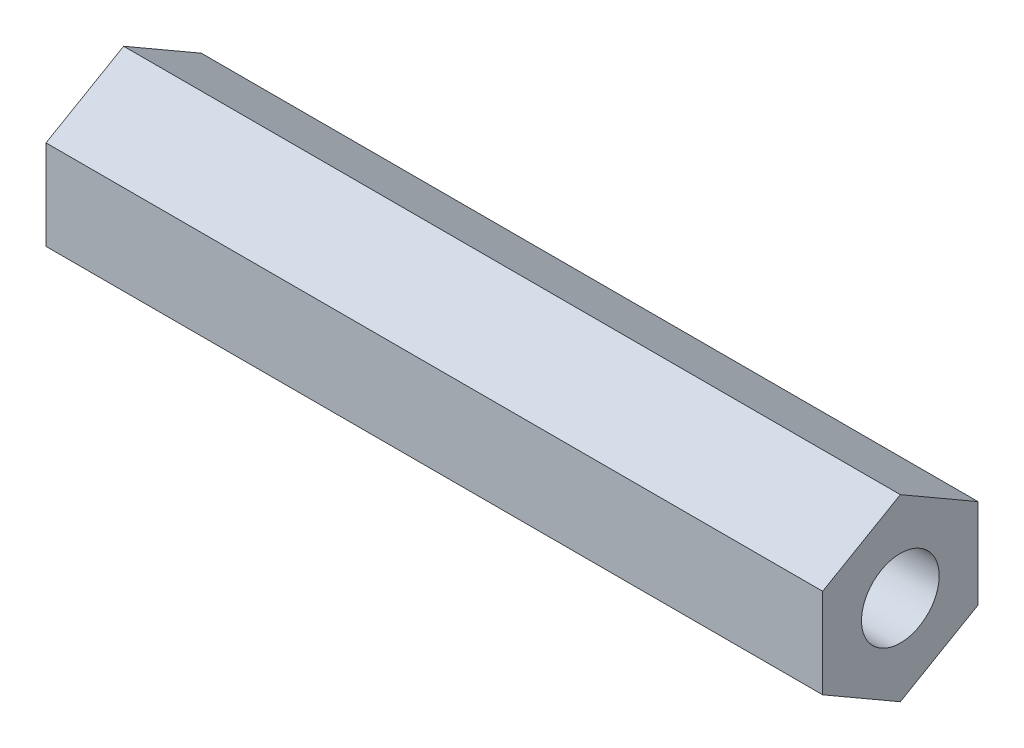
ISO-10303-21;
HEADER;
FILE_DESCRIPTION(('STEP AP214'),'2;1');
FILE_NAME('part.step','',(''),(''),'','','');
FILE_SCHEMA(('AUTOMOTIVE_DESIGN { 1 0 10303 214 1 1 1 1 }'));
ENDSEC;
DATA;
#1=APPLICATION_CONTEXT('core data for automotive mechanical design processes');
#2=APPLICATION_PROTOCOL_DEFINITION('international standard','automotive_design',2000,#1);
#3=PRODUCT_CONTEXT('',#1,'mechanical');
#4=PRODUCT('Part','Part','',(#3));
#5=PRODUCT_RELATED_PRODUCT_CATEGORY('part','',(#4));
#6=PRODUCT_DEFINITION_FORMATION('','',#4);
#7=PRODUCT_DEFINITION_CONTEXT('part definition',#1,'design');
#8=PRODUCT_DEFINITION('design','',#6,#7);
#9=PRODUCT_DEFINITION_SHAPE('','',#8);
#10=(LENGTH_UNIT() NAMED_UNIT(*) SI_UNIT(.MILLI.,.METRE.));
#11=(NAMED_UNIT(*) PLANE_ANGLE_UNIT() SI_UNIT($,.RADIAN.));
#12=(NAMED_UNIT(*) SI_UNIT($,.STERADIAN.) SOLID_ANGLE_UNIT());
#13=UNCERTAINTY_MEASURE_WITH_UNIT(LENGTH_MEASURE(1.E-05),#10,'distance_accuracy_value','');
#14=(GEOMETRIC_REPRESENTATION_CONTEXT(3) GLOBAL_UNCERTAINTY_ASSIGNED_CONTEXT((#13)) GLOBAL_UNIT_ASSIGNED_CONTEXT((#10,
#11,#12)) REPRESENTATION_CONTEXT('',''));
#15=CARTESIAN_POINT('',(0.,0.,0.));
#16=DIRECTION('',(0.,0.,1.));
#17=DIRECTION('',(1.,0.,0.));
#18=AXIS2_PLACEMENT_3D('',#15,#16,#17);
#19=CARTESIAN_POINT('',(30.,0.,0.));
#20=DIRECTION('',(1.,0.,0.));
#21=DIRECTION('',(0.,0.,-1.));
#22=AXIS2_PLACEMENT_3D('',#19,#20,#21);
#23=PLANE('',#22);
#24=DIRECTION('',(0.,0.5,0.866025403784438));
#25=VECTOR('',#24,1.);
#26=CARTESIAN_POINT('',(30.,6.54507984553655,39.7283363635929));
#27=LINE('',#26,#25);
#28=CARTESIAN_POINT('',(30.,6.54507984553655,39.7283363635929));
#29=VERTEX_POINT('',#28);
#30=CARTESIAN_POINT('',(30.,8.27713065310544,42.7283363635929));
#31=VERTEX_POINT('',#30);
#32=EDGE_CURVE('E146',#29,#31,#27,.T.);
#33=ORIENTED_EDGE('',*,*,#32,.T.);
#34=DIRECTION('',(0.,-0.500000000000001,0.866025403784438));
#35=VECTOR('',#34,1.);
#36=CARTESIAN_POINT('',(30.,8.27713065310544,42.7283363635929));
#37=LINE('',#36,#35);
#38=CARTESIAN_POINT('',(30.,6.54507984553656,45.7283363635929));
#39=VERTEX_POINT('',#38);
#40=EDGE_CURVE('E94',#31,#39,#37,.T.);
#41=ORIENTED_EDGE('',*,*,#40,.T.);
#42=DIRECTION('',(0.,-1.,0.));
#43=VECTOR('',#42,1.);
#44=CARTESIAN_POINT('',(30.,6.54507984553656,45.7283363635929));
#45=LINE('',#44,#43);
#46=CARTESIAN_POINT('',(30.,3.08097823039881,45.7283363635929));
#47=VERTEX_POINT('',#46);
#48=EDGE_CURVE('E107',#39,#47,#45,.T.);
#49=ORIENTED_EDGE('',*,*,#48,.T.);
#50=DIRECTION('',(0.,-0.5,-0.866025403784439));
#51=VECTOR('',#50,1.);
#52=CARTESIAN_POINT('',(30.,3.08097823039881,45.7283363635929));
#53=LINE('',#52,#51);
#54=CARTESIAN_POINT('',(30.,1.34892742282993,42.7283363635929));
#55=VERTEX_POINT('',#54);
#56=EDGE_CURVE('E101',#47,#55,#53,.T.);
#57=ORIENTED_EDGE('',*,*,#56,.T.);
#58=DIRECTION('',(0.,0.5,-0.866025403784439));
#59=VECTOR('',#58,1.);
#60=CARTESIAN_POINT('',(30.,1.34892742282993,42.7283363635929));
#61=LINE('',#60,#59);
#62=CARTESIAN_POINT('',(30.,3.0809782303988,39.7283363635929));
#63=VERTEX_POINT('',#62);
#64=EDGE_CURVE('E105',#55,#63,#61,.T.);
#65=ORIENTED_EDGE('',*,*,#64,.T.);
#66=DIRECTION('',(0.,1.,0.));
#67=VECTOR('',#66,1.);
#68=CARTESIAN_POINT('',(30.,3.0809782303988,39.7283363635929));
#69=LINE('',#68,#67);
#70=EDGE_CURVE('E57',#63,#29,#69,.T.);
#71=ORIENTED_EDGE('',*,*,#70,.T.);
#72=EDGE_LOOP('',(#33,#41,#49,#57,#65,#71));
#73=FACE_BOUND('',#72,.T.);
#74=CARTESIAN_POINT('',(30.,4.81302903796769,42.7283363635929));
#75=DIRECTION('',(1.,0.,0.));
#76=DIRECTION('',(0.,0.,-1.));
#77=AXIS2_PLACEMENT_3D('',#74,#75,#76);
#78=CIRCLE('',#77,1.5);
#79=CARTESIAN_POINT('',(30.,4.81302903796769,41.2283363635929));
#80=VERTEX_POINT('',#79);
#81=EDGE_CURVE('E134',#80,#80,#78,.T.);
#82=ORIENTED_EDGE('',*,*,#81,.F.);
#83=EDGE_LOOP('',(#82));
#84=FACE_BOUND('',#83,.T.);
#85=ADVANCED_FACE('F39',(#73,#84),#23,.T.);
#86=CARTESIAN_POINT('',(0.,0.,0.));
#87=DIRECTION('',(1.,0.,0.));
#88=DIRECTION('',(0.,0.,-1.));
#89=AXIS2_PLACEMENT_3D('',#86,#87,#88);
#90=PLANE('',#89);
#91=DIRECTION('',(0.,0.5,0.866025403784438));
#92=VECTOR('',#91,1.);
#93=CARTESIAN_POINT('',(0.,6.54507984553655,39.7283363635929));
#94=LINE('',#93,#92);
#95=CARTESIAN_POINT('',(0.,6.54507984553655,39.7283363635929));
#96=VERTEX_POINT('',#95);
#97=CARTESIAN_POINT('',(0.,8.27713065310544,42.7283363635929));
#98=VERTEX_POINT('',#97);
#99=EDGE_CURVE('E129',#96,#98,#94,.T.);
#100=ORIENTED_EDGE('',*,*,#99,.F.);
#101=DIRECTION('',(0.,1.,0.));
#102=VECTOR('',#101,1.);
#103=CARTESIAN_POINT('',(0.,3.0809782303988,39.7283363635929));
#104=LINE('',#103,#102);
#105=CARTESIAN_POINT('',(0.,3.0809782303988,39.7283363635929));
#106=VERTEX_POINT('',#105);
#107=EDGE_CURVE('E86',#106,#96,#104,.T.);
#108=ORIENTED_EDGE('',*,*,#107,.F.);
#109=DIRECTION('',(0.,0.5,-0.866025403784439));
#110=VECTOR('',#109,1.);
#111=CARTESIAN_POINT('',(0.,1.34892742282993,42.7283363635929));
#112=LINE('',#111,#110);
#113=CARTESIAN_POINT('',(0.,1.34892742282993,42.7283363635929));
#114=VERTEX_POINT('',#113);
#115=EDGE_CURVE('E80',#114,#106,#112,.T.);
#116=ORIENTED_EDGE('',*,*,#115,.F.);
#117=DIRECTION('',(0.,-0.5,-0.866025403784439));
#118=VECTOR('',#117,1.);
#119=CARTESIAN_POINT('',(0.,3.08097823039881,45.7283363635929));
#120=LINE('',#119,#118);
#121=CARTESIAN_POINT('',(0.,3.08097823039881,45.7283363635929));
#122=VERTEX_POINT('',#121);
#123=EDGE_CURVE('E116',#122,#114,#120,.T.);
#124=ORIENTED_EDGE('',*,*,#123,.F.);
#125=DIRECTION('',(0.,-1.,0.));
#126=VECTOR('',#125,1.);
#127=CARTESIAN_POINT('',(0.,6.54507984553656,45.7283363635929));
#128=LINE('',#127,#126);
#129=CARTESIAN_POINT('',(0.,6.54507984553656,45.7283363635929));
#130=VERTEX_POINT('',#129);
#131=EDGE_CURVE('E137',#130,#122,#128,.T.);
#132=ORIENTED_EDGE('',*,*,#131,.F.);
#133=DIRECTION('',(0.,-0.500000000000001,0.866025403784438));
#134=VECTOR('',#133,1.);
#135=CARTESIAN_POINT('',(0.,8.27713065310544,42.7283363635929));
#136=LINE('',#135,#134);
#137=EDGE_CURVE('E133',#98,#130,#136,.T.);
#138=ORIENTED_EDGE('',*,*,#137,.F.);
#139=EDGE_LOOP('',(#100,#108,#116,#124,#132,#138));
#140=FACE_BOUND('',#139,.T.);
#141=CARTESIAN_POINT('',(0.,4.81302903796769,42.7283363635929));
#142=DIRECTION('',(1.,0.,0.));
#143=DIRECTION('',(0.,0.,-1.));
#144=AXIS2_PLACEMENT_3D('',#141,#142,#143);
#145=CIRCLE('',#144,1.5);
#146=CARTESIAN_POINT('',(0.,4.81302903796769,41.2283363635929));
#147=VERTEX_POINT('',#146);
#148=EDGE_CURVE('E243',#147,#147,#145,.T.);
#149=ORIENTED_EDGE('',*,*,#148,.T.);
#150=EDGE_LOOP('',(#149));
#151=FACE_BOUND('',#150,.T.);
#152=ADVANCED_FACE('F159',(#140,#151),#90,.F.);
#153=CARTESIAN_POINT('',(30.,6.54507984553655,39.7283363635929));
#154=DIRECTION('',(0.,-0.866025403784438,0.5));
#155=DIRECTION('',(0.,-0.5,-0.866025403784439));
#156=AXIS2_PLACEMENT_3D('',#153,#154,#155);
#157=PLANE('',#156);
#158=ORIENTED_EDGE('',*,*,#99,.T.);
#159=DIRECTION('',(-1.,0.,0.));
#160=VECTOR('',#159,1.);
#161=CARTESIAN_POINT('',(30.,8.27713065310544,42.7283363635929));
#162=LINE('',#161,#160);
#163=EDGE_CURVE('E11',#31,#98,#162,.T.);
#164=ORIENTED_EDGE('',*,*,#163,.F.);
#165=ORIENTED_EDGE('',*,*,#32,.F.);
#166=DIRECTION('',(-1.,0.,0.));
#167=VECTOR('',#166,1.);
#168=CARTESIAN_POINT('',(30.,6.54507984553655,39.7283363635929));
#169=LINE('',#168,#167);
#170=EDGE_CURVE('E125',#29,#96,#169,.T.);
#171=ORIENTED_EDGE('',*,*,#170,.T.);
#172=EDGE_LOOP('',(#158,#164,#165,#171));
#173=FACE_BOUND('',#172,.T.);
#174=ADVANCED_FACE('F41',(#173),#157,.F.);
#175=CARTESIAN_POINT('',(30.,8.27713065310544,42.7283363635929));
#176=DIRECTION('',(0.,-0.866025403784438,-0.500000000000001));
#177=DIRECTION('',(0.,0.500000000000001,-0.866025403784438));
#178=AXIS2_PLACEMENT_3D('',#175,#176,#177);
#179=PLANE('',#178);
#180=ORIENTED_EDGE('',*,*,#137,.T.);
#181=DIRECTION('',(-1.,0.,0.));
#182=VECTOR('',#181,1.);
#183=CARTESIAN_POINT('',(30.,6.54507984553656,45.7283363635929));
#184=LINE('',#183,#182);
#185=EDGE_CURVE('E49',#39,#130,#184,.T.);
#186=ORIENTED_EDGE('',*,*,#185,.F.);
#187=ORIENTED_EDGE('',*,*,#40,.F.);
#188=ORIENTED_EDGE('',*,*,#163,.T.);
#189=EDGE_LOOP('',(#180,#186,#187,#188));
#190=FACE_BOUND('',#189,.T.);
#191=ADVANCED_FACE('F184',(#190),#179,.F.);
#192=CARTESIAN_POINT('',(30.,6.54507984553656,45.7283363635929));
#193=DIRECTION('',(0.,0.,-1.));
#194=DIRECTION('',(-1.,0.,0.));
#195=AXIS2_PLACEMENT_3D('',#192,#193,#194);
#196=PLANE('',#195);
#197=ORIENTED_EDGE('',*,*,#131,.T.);
#198=DIRECTION('',(-1.,0.,0.));
#199=VECTOR('',#198,1.);
#200=CARTESIAN_POINT('',(30.,3.08097823039881,45.7283363635929));
#201=LINE('',#200,#199);
#202=EDGE_CURVE('E118',#47,#122,#201,.T.);
#203=ORIENTED_EDGE('',*,*,#202,.F.);
#204=ORIENTED_EDGE('',*,*,#48,.F.);
#205=ORIENTED_EDGE('',*,*,#185,.T.);
#206=EDGE_LOOP('',(#197,#203,#204,#205));
#207=FACE_BOUND('',#206,.T.);
#208=ADVANCED_FACE('F156',(#207),#196,.F.);
#209=CARTESIAN_POINT('',(30.,3.08097823039881,45.7283363635929));
#210=DIRECTION('',(0.,0.866025403784439,-0.5));
#211=DIRECTION('',(0.,0.5,0.866025403784439));
#212=AXIS2_PLACEMENT_3D('',#209,#210,#211);
#213=PLANE('',#212);
#214=ORIENTED_EDGE('',*,*,#123,.T.);
#215=DIRECTION('',(-1.,0.,0.));
#216=VECTOR('',#215,1.);
#217=CARTESIAN_POINT('',(30.,1.34892742282993,42.7283363635929));
#218=LINE('',#217,#216);
#219=EDGE_CURVE('E113',#55,#114,#218,.T.);
#220=ORIENTED_EDGE('',*,*,#219,.F.);
#221=ORIENTED_EDGE('',*,*,#56,.F.);
#222=ORIENTED_EDGE('',*,*,#202,.T.);
#223=EDGE_LOOP('',(#214,#220,#221,#222));
#224=FACE_BOUND('',#223,.T.);
#225=ADVANCED_FACE('F114',(#224),#213,.F.);
#226=CARTESIAN_POINT('',(30.,1.34892742282993,42.7283363635929));
#227=DIRECTION('',(0.,0.866025403784439,0.5));
#228=DIRECTION('',(0.,-0.5,0.866025403784439));
#229=AXIS2_PLACEMENT_3D('',#226,#227,#228);
#230=PLANE('',#229);
#231=ORIENTED_EDGE('',*,*,#115,.T.);
#232=DIRECTION('',(-1.,0.,0.));
#233=VECTOR('',#232,1.);
#234=CARTESIAN_POINT('',(30.,3.0809782303988,39.7283363635929));
#235=LINE('',#234,#233);
#236=EDGE_CURVE('E119',#63,#106,#235,.T.);
#237=ORIENTED_EDGE('',*,*,#236,.F.);
#238=ORIENTED_EDGE('',*,*,#64,.F.);
#239=ORIENTED_EDGE('',*,*,#219,.T.);
#240=EDGE_LOOP('',(#231,#237,#238,#239));
#241=FACE_BOUND('',#240,.T.);
#242=ADVANCED_FACE('F121',(#241),#230,.F.);
#243=CARTESIAN_POINT('',(30.,3.0809782303988,39.7283363635929));
#244=DIRECTION('',(0.,0.,1.));
#245=DIRECTION('',(1.,0.,0.));
#246=AXIS2_PLACEMENT_3D('',#243,#244,#245);
#247=PLANE('',#246);
#248=ORIENTED_EDGE('',*,*,#107,.T.);
#249=ORIENTED_EDGE('',*,*,#170,.F.);
#250=ORIENTED_EDGE('',*,*,#70,.F.);
#251=ORIENTED_EDGE('',*,*,#236,.T.);
#252=EDGE_LOOP('',(#248,#249,#250,#251));
#253=FACE_BOUND('',#252,.T.);
#254=ADVANCED_FACE('F164',(#253),#247,.F.);
#255=CARTESIAN_POINT('',(30.,4.81302903796769,42.7283363635929));
#256=DIRECTION('',(-1.,0.,0.));
#257=DIRECTION('',(0.,0.,1.));
#258=AXIS2_PLACEMENT_3D('',#255,#256,#257);
#259=CYLINDRICAL_SURFACE('',#258,1.5);
#260=ORIENTED_EDGE('',*,*,#81,.T.);
#261=EDGE_LOOP('',(#260));
#262=FACE_BOUND('',#261,.T.);
#263=ORIENTED_EDGE('',*,*,#148,.F.);
#264=EDGE_LOOP('',(#263));
#265=FACE_BOUND('',#264,.T.);
#266=ADVANCED_FACE('F166',(#262,#265),#259,.F.);
#267=CLOSED_SHELL('',(#85,#152,#174,#191,#208,#225,#242,#254,#266));
#268=MANIFOLD_SOLID_BREP('B2',#267);
#269=ADVANCED_BREP_SHAPE_REPRESENTATION('',(#18,#268),#14);
#270=SHAPE_DEFINITION_REPRESENTATION(#9,#269);
ENDSEC;
END-ISO-10303-21;
